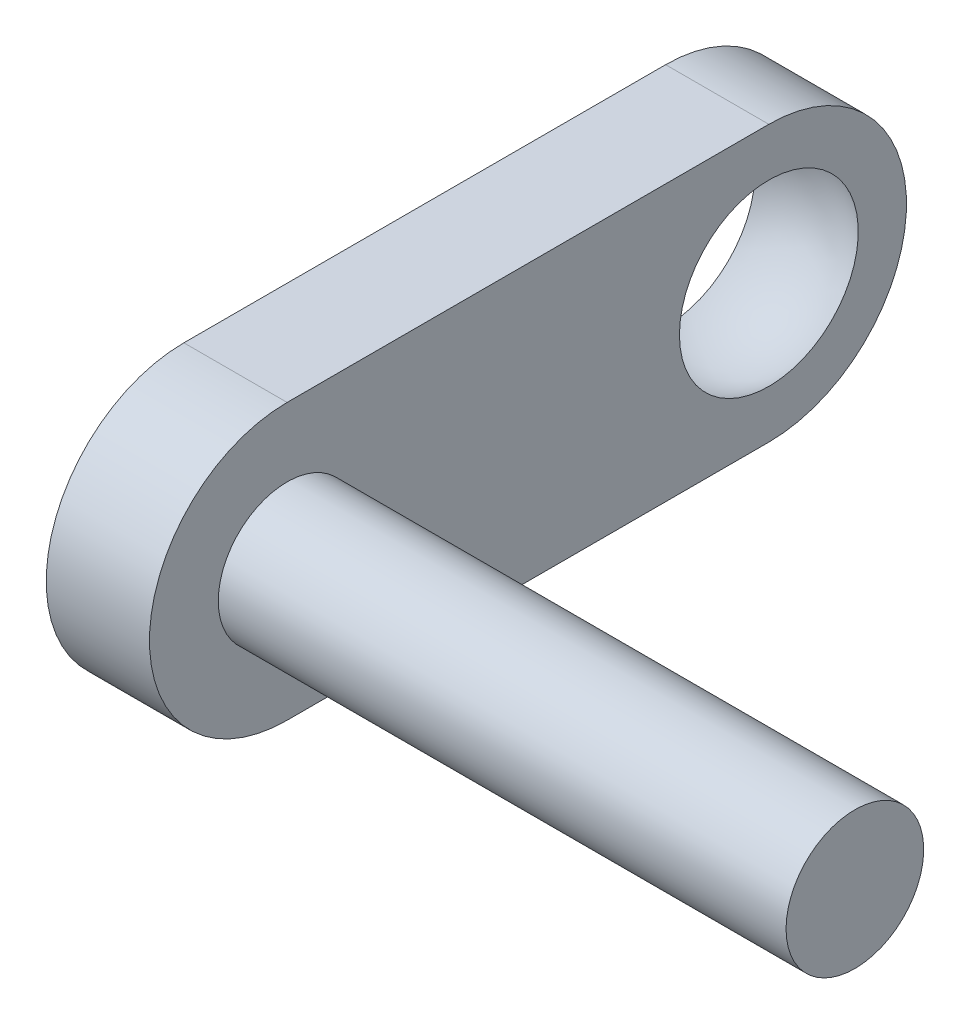
ISO-10303-21;
HEADER;
FILE_DESCRIPTION(('STEP AP214'),'2;1');
FILE_NAME('part.step','',(''),(''),'','','');
FILE_SCHEMA(('AUTOMOTIVE_DESIGN { 1 0 10303 214 1 1 1 1 }'));
ENDSEC;
DATA;
#1=APPLICATION_CONTEXT('core data for automotive mechanical design processes');
#2=APPLICATION_PROTOCOL_DEFINITION('international standard','automotive_design',2000,#1);
#3=PRODUCT_CONTEXT('',#1,'mechanical');
#4=PRODUCT('Part','Part','',(#3));
#5=PRODUCT_RELATED_PRODUCT_CATEGORY('part','',(#4));
#6=PRODUCT_DEFINITION_FORMATION('','',#4);
#7=PRODUCT_DEFINITION_CONTEXT('part definition',#1,'design');
#8=PRODUCT_DEFINITION('design','',#6,#7);
#9=PRODUCT_DEFINITION_SHAPE('','',#8);
#10=(LENGTH_UNIT() NAMED_UNIT(*) SI_UNIT(.MILLI.,.METRE.));
#11=(NAMED_UNIT(*) PLANE_ANGLE_UNIT() SI_UNIT($,.RADIAN.));
#12=(NAMED_UNIT(*) SI_UNIT($,.STERADIAN.) SOLID_ANGLE_UNIT());
#13=UNCERTAINTY_MEASURE_WITH_UNIT(LENGTH_MEASURE(1.E-05),#10,'distance_accuracy_value','');
#14=(GEOMETRIC_REPRESENTATION_CONTEXT(3) GLOBAL_UNCERTAINTY_ASSIGNED_CONTEXT((#13)) GLOBAL_UNIT_ASSIGNED_CONTEXT((#10,
#11,#12)) REPRESENTATION_CONTEXT('',''));
#15=CARTESIAN_POINT('',(0.,0.,0.));
#16=DIRECTION('',(0.,0.,1.));
#17=DIRECTION('',(1.,0.,0.));
#18=AXIS2_PLACEMENT_3D('',#15,#16,#17);
#19=CARTESIAN_POINT('',(-24.2766793425524,33.,5.));
#20=DIRECTION('',(0.,0.,-1.));
#21=DIRECTION('',(0.,1.,0.));
#22=AXIS2_PLACEMENT_3D('',#19,#20,#21);
#23=SPHERICAL_SURFACE('',#22,3.);
#24=CARTESIAN_POINT('',(-24.2766793425524,33.,5.));
#25=DIRECTION('',(-1.,0.,0.));
#26=DIRECTION('',(0.,0.,1.));
#27=AXIS2_PLACEMENT_3D('',#24,#25,#26);
#28=SPHERICAL_SURFACE('',#27,3.);
#29=CARTESIAN_POINT('',(-22.7766793425524,33.,5.));
#30=DIRECTION('',(-1.,0.,0.));
#31=DIRECTION('',(0.,0.,1.));
#32=AXIS2_PLACEMENT_3D('',#29,#30,#31);
#33=CIRCLE('',#32,2.59807621135331);
#34=CARTESIAN_POINT('',(-22.7766793425524,33.,7.59807621135332));
#35=VERTEX_POINT('',#34);
#36=EDGE_CURVE('E11',#35,#35,#33,.F.);
#37=ORIENTED_EDGE('',*,*,#36,.T.);
#38=EDGE_LOOP('',(#37));
#39=FACE_BOUND('',#38,.T.);
#40=CARTESIAN_POINT('',(-25.7766793425524,33.,5.));
#41=DIRECTION('',(-1.,0.,0.));
#42=DIRECTION('',(0.,0.,1.));
#43=AXIS2_PLACEMENT_3D('',#40,#41,#42);
#44=CIRCLE('',#43,2.59807621135332);
#45=CARTESIAN_POINT('',(-25.7766793425524,33.,7.59807621135332));
#46=VERTEX_POINT('',#45);
#47=EDGE_CURVE('E44',#46,#46,#44,.F.);
#48=ORIENTED_EDGE('',*,*,#47,.F.);
#49=EDGE_LOOP('',(#48));
#50=FACE_BOUND('',#49,.T.);
#51=ADVANCED_FACE('F41',(#39,#50),#28,.F.);
#52=CARTESIAN_POINT('',(-6.27667934255235,33.,19.));
#53=DIRECTION('',(-1.,0.,0.));
#54=DIRECTION('',(0.,0.,1.));
#55=AXIS2_PLACEMENT_3D('',#52,#53,#54);
#56=PLANE('',#55);
#57=CARTESIAN_POINT('',(-6.27667934255235,33.,19.));
#58=DIRECTION('',(-1.,0.,0.));
#59=DIRECTION('',(0.,0.,1.));
#60=AXIS2_PLACEMENT_3D('',#57,#58,#59);
#61=CIRCLE('',#60,2.00000000000001);
#62=CARTESIAN_POINT('',(-6.27667934255235,33.,21.));
#63=VERTEX_POINT('',#62);
#64=EDGE_CURVE('E118',#63,#63,#61,.T.);
#65=ORIENTED_EDGE('',*,*,#64,.F.);
#66=EDGE_LOOP('',(#65));
#67=FACE_BOUND('',#66,.T.);
#68=ADVANCED_FACE('F145',(#67),#56,.F.);
#69=CARTESIAN_POINT('',(-25.7766793425524,29.,5.));
#70=DIRECTION('',(0.,1.,0.));
#71=DIRECTION('',(0.,0.,1.));
#72=AXIS2_PLACEMENT_3D('',#69,#70,#71);
#73=PLANE('',#72);
#74=DIRECTION('',(0.,0.,1.));
#75=VECTOR('',#74,1.);
#76=CARTESIAN_POINT('',(-22.7766793425524,29.,5.));
#77=LINE('',#76,#75);
#78=CARTESIAN_POINT('',(-22.7766793425524,29.,5.));
#79=VERTEX_POINT('',#78);
#80=CARTESIAN_POINT('',(-22.7766793425524,29.,19.));
#81=VERTEX_POINT('',#80);
#82=EDGE_CURVE('E98',#79,#81,#77,.T.);
#83=ORIENTED_EDGE('',*,*,#82,.T.);
#84=DIRECTION('',(1.,0.,0.));
#85=VECTOR('',#84,1.);
#86=CARTESIAN_POINT('',(-25.7766793425524,29.,19.));
#87=LINE('',#86,#85);
#88=CARTESIAN_POINT('',(-25.7766793425524,29.,19.));
#89=VERTEX_POINT('',#88);
#90=EDGE_CURVE('E96',#89,#81,#87,.T.);
#91=ORIENTED_EDGE('',*,*,#90,.F.);
#92=DIRECTION('',(0.,0.,1.));
#93=VECTOR('',#92,1.);
#94=CARTESIAN_POINT('',(-25.7766793425524,29.,5.));
#95=LINE('',#94,#93);
#96=CARTESIAN_POINT('',(-25.7766793425524,29.,5.));
#97=VERTEX_POINT('',#96);
#98=EDGE_CURVE('E88',#97,#89,#95,.T.);
#99=ORIENTED_EDGE('',*,*,#98,.F.);
#100=DIRECTION('',(1.,0.,0.));
#101=VECTOR('',#100,1.);
#102=CARTESIAN_POINT('',(-25.7766793425524,29.,5.));
#103=LINE('',#102,#101);
#104=EDGE_CURVE('E99',#97,#79,#103,.T.);
#105=ORIENTED_EDGE('',*,*,#104,.T.);
#106=EDGE_LOOP('',(#83,#91,#99,#105));
#107=FACE_BOUND('',#106,.T.);
#108=ADVANCED_FACE('F97',(#107),#73,.F.);
#109=CARTESIAN_POINT('',(-25.7766793425524,33.,19.));
#110=DIRECTION('',(1.,0.,0.));
#111=DIRECTION('',(0.,0.,-1.));
#112=AXIS2_PLACEMENT_3D('',#109,#110,#111);
#113=CYLINDRICAL_SURFACE('',#112,4.);
#114=CARTESIAN_POINT('',(-22.7766793425524,33.,19.));
#115=DIRECTION('',(-1.,0.,0.));
#116=DIRECTION('',(0.,0.,1.));
#117=AXIS2_PLACEMENT_3D('',#114,#115,#116);
#118=CIRCLE('',#117,4.);
#119=CARTESIAN_POINT('',(-22.7766793425524,37.,19.));
#120=VERTEX_POINT('',#119);
#121=EDGE_CURVE('E74',#81,#120,#118,.T.);
#122=ORIENTED_EDGE('',*,*,#121,.T.);
#123=DIRECTION('',(1.,0.,0.));
#124=VECTOR('',#123,1.);
#125=CARTESIAN_POINT('',(-25.7766793425524,37.,19.));
#126=LINE('',#125,#124);
#127=CARTESIAN_POINT('',(-25.7766793425524,37.,19.));
#128=VERTEX_POINT('',#127);
#129=EDGE_CURVE('E100',#128,#120,#126,.T.);
#130=ORIENTED_EDGE('',*,*,#129,.F.);
#131=CARTESIAN_POINT('',(-25.7766793425524,33.,19.));
#132=DIRECTION('',(-1.,0.,0.));
#133=DIRECTION('',(0.,0.,1.));
#134=AXIS2_PLACEMENT_3D('',#131,#132,#133);
#135=CIRCLE('',#134,4.);
#136=EDGE_CURVE('E91',#89,#128,#135,.T.);
#137=ORIENTED_EDGE('',*,*,#136,.F.);
#138=ORIENTED_EDGE('',*,*,#90,.T.);
#139=EDGE_LOOP('',(#122,#130,#137,#138));
#140=FACE_BOUND('',#139,.T.);
#141=ADVANCED_FACE('F102',(#140),#113,.T.);
#142=CARTESIAN_POINT('',(-25.7766793425524,37.,5.));
#143=DIRECTION('',(0.,-1.,0.));
#144=DIRECTION('',(0.,0.,-1.));
#145=AXIS2_PLACEMENT_3D('',#142,#143,#144);
#146=PLANE('',#145);
#147=DIRECTION('',(0.,0.,-1.));
#148=VECTOR('',#147,1.);
#149=CARTESIAN_POINT('',(-22.7766793425524,37.,5.));
#150=LINE('',#149,#148);
#151=CARTESIAN_POINT('',(-22.7766793425524,37.,5.));
#152=VERTEX_POINT('',#151);
#153=EDGE_CURVE('E80',#120,#152,#150,.T.);
#154=ORIENTED_EDGE('',*,*,#153,.T.);
#155=DIRECTION('',(1.,0.,0.));
#156=VECTOR('',#155,1.);
#157=CARTESIAN_POINT('',(-25.7766793425524,37.,5.));
#158=LINE('',#157,#156);
#159=CARTESIAN_POINT('',(-25.7766793425524,37.,5.));
#160=VERTEX_POINT('',#159);
#161=EDGE_CURVE('E104',#160,#152,#158,.T.);
#162=ORIENTED_EDGE('',*,*,#161,.F.);
#163=DIRECTION('',(0.,0.,-1.));
#164=VECTOR('',#163,1.);
#165=CARTESIAN_POINT('',(-25.7766793425524,37.,5.));
#166=LINE('',#165,#164);
#167=EDGE_CURVE('E57',#128,#160,#166,.T.);
#168=ORIENTED_EDGE('',*,*,#167,.F.);
#169=ORIENTED_EDGE('',*,*,#129,.T.);
#170=EDGE_LOOP('',(#154,#162,#168,#169));
#171=FACE_BOUND('',#170,.T.);
#172=ADVANCED_FACE('F134',(#171),#146,.F.);
#173=CARTESIAN_POINT('',(-25.7766793425524,33.,5.));
#174=DIRECTION('',(1.,0.,0.));
#175=DIRECTION('',(0.,0.,-1.));
#176=AXIS2_PLACEMENT_3D('',#173,#174,#175);
#177=CYLINDRICAL_SURFACE('',#176,4.);
#178=CARTESIAN_POINT('',(-22.7766793425524,33.,5.));
#179=DIRECTION('',(-1.,0.,0.));
#180=DIRECTION('',(0.,0.,1.));
#181=AXIS2_PLACEMENT_3D('',#178,#179,#180);
#182=CIRCLE('',#181,4.);
#183=EDGE_CURVE('E108',#152,#79,#182,.T.);
#184=ORIENTED_EDGE('',*,*,#183,.T.);
#185=ORIENTED_EDGE('',*,*,#104,.F.);
#186=CARTESIAN_POINT('',(-25.7766793425524,33.,5.));
#187=DIRECTION('',(-1.,0.,0.));
#188=DIRECTION('',(0.,0.,1.));
#189=AXIS2_PLACEMENT_3D('',#186,#187,#188);
#190=CIRCLE('',#189,4.);
#191=EDGE_CURVE('E93',#160,#97,#190,.T.);
#192=ORIENTED_EDGE('',*,*,#191,.F.);
#193=ORIENTED_EDGE('',*,*,#161,.T.);
#194=EDGE_LOOP('',(#184,#185,#192,#193));
#195=FACE_BOUND('',#194,.T.);
#196=ADVANCED_FACE('F133',(#195),#177,.T.);
#197=CARTESIAN_POINT('',(-6.27667934255235,33.,19.));
#198=DIRECTION('',(-1.,0.,0.));
#199=DIRECTION('',(0.,0.,1.));
#200=AXIS2_PLACEMENT_3D('',#197,#198,#199);
#201=CYLINDRICAL_SURFACE('',#200,2.00000000000001);
#202=ORIENTED_EDGE('',*,*,#64,.T.);
#203=EDGE_LOOP('',(#202));
#204=FACE_BOUND('',#203,.T.);
#205=CARTESIAN_POINT('',(-22.7766793425524,33.,19.));
#206=DIRECTION('',(-1.,0.,0.));
#207=DIRECTION('',(0.,0.,1.));
#208=AXIS2_PLACEMENT_3D('',#205,#206,#207);
#209=CIRCLE('',#208,2.00000000000001);
#210=CARTESIAN_POINT('',(-22.7766793425524,33.,21.));
#211=VERTEX_POINT('',#210);
#212=EDGE_CURVE('E117',#211,#211,#209,.F.);
#213=ORIENTED_EDGE('',*,*,#212,.T.);
#214=EDGE_LOOP('',(#213));
#215=FACE_BOUND('',#214,.T.);
#216=ADVANCED_FACE('F124',(#204,#215),#201,.T.);
#217=CARTESIAN_POINT('',(-22.7766793425524,33.,5.));
#218=DIRECTION('',(-1.,0.,0.));
#219=DIRECTION('',(0.,0.,1.));
#220=AXIS2_PLACEMENT_3D('',#217,#218,#219);
#221=PLANE('',#220);
#222=ORIENTED_EDGE('',*,*,#36,.F.);
#223=EDGE_LOOP('',(#222));
#224=FACE_BOUND('',#223,.T.);
#225=ORIENTED_EDGE('',*,*,#212,.F.);
#226=EDGE_LOOP('',(#225));
#227=FACE_BOUND('',#226,.T.);
#228=ORIENTED_EDGE('',*,*,#183,.F.);
#229=ORIENTED_EDGE('',*,*,#153,.F.);
#230=ORIENTED_EDGE('',*,*,#121,.F.);
#231=ORIENTED_EDGE('',*,*,#82,.F.);
#232=EDGE_LOOP('',(#228,#229,#230,#231));
#233=FACE_BOUND('',#232,.T.);
#234=ADVANCED_FACE('F126',(#224,#227,#233),#221,.F.);
#235=CARTESIAN_POINT('',(-25.7766793425524,33.,5.));
#236=DIRECTION('',(-1.,0.,0.));
#237=DIRECTION('',(0.,0.,1.));
#238=AXIS2_PLACEMENT_3D('',#235,#236,#237);
#239=PLANE('',#238);
#240=ORIENTED_EDGE('',*,*,#47,.T.);
#241=EDGE_LOOP('',(#240));
#242=FACE_BOUND('',#241,.T.);
#243=ORIENTED_EDGE('',*,*,#191,.T.);
#244=ORIENTED_EDGE('',*,*,#98,.T.);
#245=ORIENTED_EDGE('',*,*,#136,.T.);
#246=ORIENTED_EDGE('',*,*,#167,.T.);
#247=EDGE_LOOP('',(#243,#244,#245,#246));
#248=FACE_BOUND('',#247,.T.);
#249=ADVANCED_FACE('F89',(#242,#248),#239,.T.);
#250=CLOSED_SHELL('',(#51,#68,#108,#141,#172,#196,#216,#234,#249));
#251=MANIFOLD_SOLID_BREP('B2',#250);
#252=ADVANCED_BREP_SHAPE_REPRESENTATION('',(#18,#251),#14);
#253=SHAPE_DEFINITION_REPRESENTATION(#9,#252);
ENDSEC;
END-ISO-10303-21;
